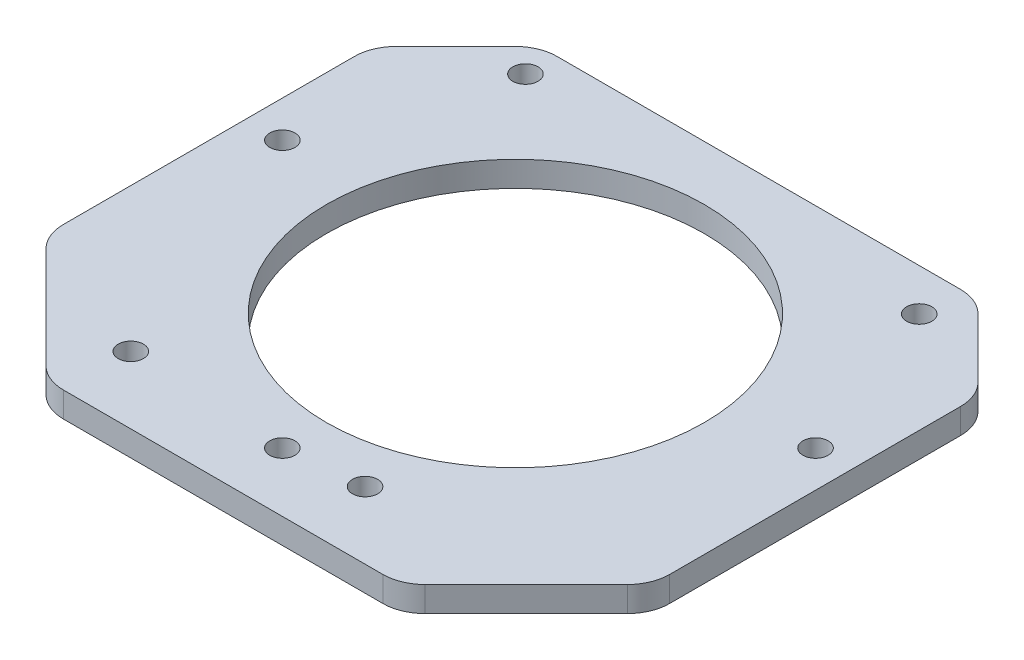
ISO-10303-21;
HEADER;
FILE_DESCRIPTION(('STEP AP214'),'2;1');
FILE_NAME('part.step','',(''),(''),'','','');
FILE_SCHEMA(('AUTOMOTIVE_DESIGN { 1 0 10303 214 1 1 1 1 }'));
ENDSEC;
DATA;
#1=APPLICATION_CONTEXT('core data for automotive mechanical design processes');
#2=APPLICATION_PROTOCOL_DEFINITION('international standard','automotive_design',2000,#1);
#3=PRODUCT_CONTEXT('',#1,'mechanical');
#4=PRODUCT('Part','Part','',(#3));
#5=PRODUCT_RELATED_PRODUCT_CATEGORY('part','',(#4));
#6=PRODUCT_DEFINITION_FORMATION('','',#4);
#7=PRODUCT_DEFINITION_CONTEXT('part definition',#1,'design');
#8=PRODUCT_DEFINITION('design','',#6,#7);
#9=PRODUCT_DEFINITION_SHAPE('','',#8);
#10=(LENGTH_UNIT() NAMED_UNIT(*) SI_UNIT(.MILLI.,.METRE.));
#11=(NAMED_UNIT(*) PLANE_ANGLE_UNIT() SI_UNIT($,.RADIAN.));
#12=(NAMED_UNIT(*) SI_UNIT($,.STERADIAN.) SOLID_ANGLE_UNIT());
#13=UNCERTAINTY_MEASURE_WITH_UNIT(LENGTH_MEASURE(1.E-05),#10,'distance_accuracy_value','');
#14=(GEOMETRIC_REPRESENTATION_CONTEXT(3) GLOBAL_UNCERTAINTY_ASSIGNED_CONTEXT((#13)) GLOBAL_UNIT_ASSIGNED_CONTEXT((#10,
#11,#12)) REPRESENTATION_CONTEXT('',''));
#15=CARTESIAN_POINT('',(0.,0.,0.));
#16=DIRECTION('',(0.,0.,1.));
#17=DIRECTION('',(1.,0.,0.));
#18=AXIS2_PLACEMENT_3D('',#15,#16,#17);
#19=CARTESIAN_POINT('',(0.,1.5,0.));
#20=DIRECTION('',(0.,1.,0.));
#21=DIRECTION('',(0.,0.,1.));
#22=AXIS2_PLACEMENT_3D('',#19,#20,#21);
#23=PLANE('',#22);
#24=CARTESIAN_POINT('',(-8.89999999999999,1.5,24.));
#25=DIRECTION('',(0.,-1.,0.));
#26=DIRECTION('',(0.,0.,-1.));
#27=AXIS2_PLACEMENT_3D('',#24,#25,#26);
#28=CIRCLE('',#27,22.5);
#29=CARTESIAN_POINT('',(-8.89999999999999,1.5,1.49999999999999));
#30=VERTEX_POINT('',#29);
#31=EDGE_CURVE('E336',#30,#30,#28,.T.);
#32=ORIENTED_EDGE('',*,*,#31,.T.);
#33=EDGE_LOOP('',(#32));
#34=FACE_BOUND('',#33,.T.);
#35=CARTESIAN_POINT('',(-40.65,1.5,20.));
#36=DIRECTION('',(0.,1.,0.));
#37=DIRECTION('',(0.,0.,-1.));
#38=AXIS2_PLACEMENT_3D('',#35,#36,#37);
#39=CIRCLE('',#38,1.5);
#40=CARTESIAN_POINT('',(-40.65,1.5,18.5));
#41=VERTEX_POINT('',#40);
#42=EDGE_CURVE('E324',#41,#41,#39,.T.);
#43=ORIENTED_EDGE('',*,*,#42,.F.);
#44=EDGE_LOOP('',(#43));
#45=FACE_BOUND('',#44,.T.);
#46=CARTESIAN_POINT('',(-27.9,1.5,50.8));
#47=DIRECTION('',(0.,1.,0.));
#48=DIRECTION('',(0.,0.,1.));
#49=AXIS2_PLACEMENT_3D('',#46,#47,#48);
#50=CIRCLE('',#49,1.5);
#51=CARTESIAN_POINT('',(-27.9,1.5,52.3));
#52=VERTEX_POINT('',#51);
#53=EDGE_CURVE('E312',#52,#52,#50,.T.);
#54=ORIENTED_EDGE('',*,*,#53,.F.);
#55=EDGE_LOOP('',(#54));
#56=FACE_BOUND('',#55,.T.);
#57=CARTESIAN_POINT('',(15.2,1.5,0.));
#58=DIRECTION('',(0.,1.,0.));
#59=DIRECTION('',(0.,0.,1.));
#60=AXIS2_PLACEMENT_3D('',#57,#58,#59);
#61=CIRCLE('',#60,1.5);
#62=CARTESIAN_POINT('',(15.2,1.5,1.5));
#63=VERTEX_POINT('',#62);
#64=EDGE_CURVE('E301',#63,#63,#61,.T.);
#65=ORIENTED_EDGE('',*,*,#64,.F.);
#66=EDGE_LOOP('',(#65));
#67=FACE_BOUND('',#66,.T.);
#68=DIRECTION('',(0.,0.,-1.));
#69=VECTOR('',#68,1.);
#70=CARTESIAN_POINT('',(27.2,1.5,-5.));
#71=LINE('',#70,#69);
#72=CARTESIAN_POINT('',(27.2,1.5,41.7289321881345));
#73=VERTEX_POINT('',#72);
#74=CARTESIAN_POINT('',(27.2,1.5,7.07106781186552));
#75=VERTEX_POINT('',#74);
#76=EDGE_CURVE('E166',#73,#75,#71,.T.);
#77=ORIENTED_EDGE('',*,*,#76,.T.);
#78=CARTESIAN_POINT('',(22.2,1.5,7.07106781186552));
#79=DIRECTION('',(0.,1.,0.));
#80=DIRECTION('',(0.,0.,1.));
#81=AXIS2_PLACEMENT_3D('',#78,#79,#80);
#82=CIRCLE('',#81,5.);
#83=CARTESIAN_POINT('',(25.7355339059327,1.5,3.53553390593279));
#84=VERTEX_POINT('',#83);
#85=EDGE_CURVE('E222',#75,#84,#82,.T.);
#86=ORIENTED_EDGE('',*,*,#85,.T.);
#87=DIRECTION('',(0.707106781186546,0.,0.707106781186549));
#88=VECTOR('',#87,1.);
#89=CARTESIAN_POINT('',(11.1,1.5,-11.1));
#90=LINE('',#89,#88);
#91=CARTESIAN_POINT('',(18.6644660940673,1.5,-3.53553390593273));
#92=VERTEX_POINT('',#91);
#93=EDGE_CURVE('E168',#84,#92,#90,.F.);
#94=ORIENTED_EDGE('',*,*,#93,.T.);
#95=CARTESIAN_POINT('',(15.1289321881345,1.5,0.));
#96=DIRECTION('',(0.,1.,0.));
#97=DIRECTION('',(0.,0.,1.));
#98=AXIS2_PLACEMENT_3D('',#95,#96,#97);
#99=CIRCLE('',#98,5.);
#100=CARTESIAN_POINT('',(15.1289321881345,1.5,-5.));
#101=VERTEX_POINT('',#100);
#102=EDGE_CURVE('E220',#92,#101,#99,.T.);
#103=ORIENTED_EDGE('',*,*,#102,.T.);
#104=DIRECTION('',(-1.,0.,0.));
#105=VECTOR('',#104,1.);
#106=CARTESIAN_POINT('',(-45.,1.5,-5.));
#107=LINE('',#106,#105);
#108=CARTESIAN_POINT('',(-32.9289321881345,1.5,-5.));
#109=VERTEX_POINT('',#108);
#110=EDGE_CURVE('E190',#101,#109,#107,.T.);
#111=ORIENTED_EDGE('',*,*,#110,.T.);
#112=CARTESIAN_POINT('',(-32.9289321881345,1.5,0.));
#113=DIRECTION('',(0.,1.,0.));
#114=DIRECTION('',(0.,0.,1.));
#115=AXIS2_PLACEMENT_3D('',#112,#113,#114);
#116=CIRCLE('',#115,5.);
#117=CARTESIAN_POINT('',(-36.4644660940672,1.5,-3.53553390593274));
#118=VERTEX_POINT('',#117);
#119=EDGE_CURVE('E216',#109,#118,#116,.T.);
#120=ORIENTED_EDGE('',*,*,#119,.T.);
#121=DIRECTION('',(0.707106781186549,0.,-0.707106781186546));
#122=VECTOR('',#121,1.);
#123=CARTESIAN_POINT('',(-19.9999999999999,1.5,-20.));
#124=LINE('',#123,#122);
#125=CARTESIAN_POINT('',(-43.5355339059327,1.5,3.53553390593275));
#126=VERTEX_POINT('',#125);
#127=EDGE_CURVE('E202',#118,#126,#124,.F.);
#128=ORIENTED_EDGE('',*,*,#127,.T.);
#129=CARTESIAN_POINT('',(-40.,1.5,7.07106781186549));
#130=DIRECTION('',(0.,1.,0.));
#131=DIRECTION('',(0.,0.,1.));
#132=AXIS2_PLACEMENT_3D('',#129,#130,#131);
#133=CIRCLE('',#132,5.);
#134=CARTESIAN_POINT('',(-45.,1.5,7.07106781186549));
#135=VERTEX_POINT('',#134);
#136=EDGE_CURVE('E218',#126,#135,#133,.T.);
#137=ORIENTED_EDGE('',*,*,#136,.T.);
#138=DIRECTION('',(0.,0.,1.));
#139=VECTOR('',#138,1.);
#140=CARTESIAN_POINT('',(-45.,1.5,-5.));
#141=LINE('',#140,#139);
#142=CARTESIAN_POINT('',(-45.,1.5,41.7289321881345));
#143=VERTEX_POINT('',#142);
#144=EDGE_CURVE('E179',#135,#143,#141,.T.);
#145=ORIENTED_EDGE('',*,*,#144,.T.);
#146=CARTESIAN_POINT('',(-40.,1.5,41.7289321881345));
#147=DIRECTION('',(0.,1.,0.));
#148=DIRECTION('',(0.,0.,1.));
#149=AXIS2_PLACEMENT_3D('',#146,#147,#148);
#150=CIRCLE('',#149,5.);
#151=CARTESIAN_POINT('',(-43.5355339059327,1.5,45.2644660940672));
#152=VERTEX_POINT('',#151);
#153=EDGE_CURVE('E210',#143,#152,#150,.T.);
#154=ORIENTED_EDGE('',*,*,#153,.T.);
#155=DIRECTION('',(-0.707106781186546,0.,-0.707106781186549));
#156=VECTOR('',#155,1.);
#157=CARTESIAN_POINT('',(-44.4,1.5,44.3999999999999));
#158=LINE('',#157,#156);
#159=CARTESIAN_POINT('',(-31.4644660940672,1.5,57.3355339059327));
#160=VERTEX_POINT('',#159);
#161=EDGE_CURVE('E192',#152,#160,#158,.F.);
#162=ORIENTED_EDGE('',*,*,#161,.T.);
#163=CARTESIAN_POINT('',(-27.9289321881345,1.5,53.8));
#164=DIRECTION('',(0.,1.,0.));
#165=DIRECTION('',(0.,0.,1.));
#166=AXIS2_PLACEMENT_3D('',#163,#164,#165);
#167=CIRCLE('',#166,5.);
#168=CARTESIAN_POINT('',(-27.9289321881345,1.5,58.8));
#169=VERTEX_POINT('',#168);
#170=EDGE_CURVE('E208',#160,#169,#167,.T.);
#171=ORIENTED_EDGE('',*,*,#170,.T.);
#172=DIRECTION('',(1.,0.,0.));
#173=VECTOR('',#172,1.);
#174=CARTESIAN_POINT('',(-45.,1.5,58.8));
#175=LINE('',#174,#173);
#176=CARTESIAN_POINT('',(10.1289321881345,1.5,58.8));
#177=VERTEX_POINT('',#176);
#178=EDGE_CURVE('E279',#169,#177,#175,.T.);
#179=ORIENTED_EDGE('',*,*,#178,.T.);
#180=CARTESIAN_POINT('',(10.1289321881345,1.5,53.8));
#181=DIRECTION('',(0.,1.,0.));
#182=DIRECTION('',(0.,0.,1.));
#183=AXIS2_PLACEMENT_3D('',#180,#181,#182);
#184=CIRCLE('',#183,5.);
#185=CARTESIAN_POINT('',(13.6644660940672,1.5,57.3355339059328));
#186=VERTEX_POINT('',#185);
#187=EDGE_CURVE('E212',#177,#186,#184,.T.);
#188=ORIENTED_EDGE('',*,*,#187,.T.);
#189=DIRECTION('',(-0.707106781186549,0.,0.707106781186546));
#190=VECTOR('',#189,1.);
#191=CARTESIAN_POINT('',(35.4999999999999,1.5,35.5000000000001));
#192=LINE('',#191,#190);
#193=CARTESIAN_POINT('',(25.7355339059327,1.5,45.2644660940673));
#194=VERTEX_POINT('',#193);
#195=EDGE_CURVE('E195',#186,#194,#192,.F.);
#196=ORIENTED_EDGE('',*,*,#195,.T.);
#197=CARTESIAN_POINT('',(22.2,1.5,41.7289321881345));
#198=DIRECTION('',(0.,1.,0.));
#199=DIRECTION('',(0.,0.,1.));
#200=AXIS2_PLACEMENT_3D('',#197,#198,#199);
#201=CIRCLE('',#200,5.);
#202=EDGE_CURVE('E214',#194,#73,#201,.T.);
#203=ORIENTED_EDGE('',*,*,#202,.T.);
#204=EDGE_LOOP('',(#77,#86,#94,#103,#111,#120,#128,#137,#145,#154,#162,#171,#179,#188,#196,#203));
#205=FACE_BOUND('',#204,.T.);
#206=CARTESIAN_POINT('',(-33.,1.5,-1.3));
#207=DIRECTION('',(0.,1.,0.));
#208=DIRECTION('',(0.,0.,1.));
#209=AXIS2_PLACEMENT_3D('',#206,#207,#208);
#210=CIRCLE('',#209,1.5);
#211=CARTESIAN_POINT('',(-33.,1.5,0.200000000000004));
#212=VERTEX_POINT('',#211);
#213=EDGE_CURVE('E292',#212,#212,#210,.T.);
#214=ORIENTED_EDGE('',*,*,#213,.F.);
#215=EDGE_LOOP('',(#214));
#216=FACE_BOUND('',#215,.T.);
#217=CARTESIAN_POINT('',(0.,1.5,50.8));
#218=DIRECTION('',(0.,1.,0.));
#219=DIRECTION('',(0.,0.,1.));
#220=AXIS2_PLACEMENT_3D('',#217,#218,#219);
#221=CIRCLE('',#220,1.5);
#222=CARTESIAN_POINT('',(0.,1.5,52.3));
#223=VERTEX_POINT('',#222);
#224=EDGE_CURVE('E306',#223,#223,#221,.T.);
#225=ORIENTED_EDGE('',*,*,#224,.F.);
#226=EDGE_LOOP('',(#225));
#227=FACE_BOUND('',#226,.T.);
#228=CARTESIAN_POINT('',(22.85,1.5,20.));
#229=DIRECTION('',(0.,1.,0.));
#230=DIRECTION('',(0.,0.,1.));
#231=AXIS2_PLACEMENT_3D('',#228,#229,#230);
#232=CIRCLE('',#231,1.5);
#233=CARTESIAN_POINT('',(22.85,1.5,21.5));
#234=VERTEX_POINT('',#233);
#235=EDGE_CURVE('E318',#234,#234,#232,.T.);
#236=ORIENTED_EDGE('',*,*,#235,.F.);
#237=EDGE_LOOP('',(#236));
#238=FACE_BOUND('',#237,.T.);
#239=CARTESIAN_POINT('',(-8.9,1.5,51.75));
#240=DIRECTION('',(0.,1.,0.));
#241=DIRECTION('',(0.,0.,1.));
#242=AXIS2_PLACEMENT_3D('',#239,#240,#241);
#243=CIRCLE('',#242,1.5);
#244=CARTESIAN_POINT('',(-8.9,1.5,53.25));
#245=VERTEX_POINT('',#244);
#246=EDGE_CURVE('E330',#245,#245,#243,.T.);
#247=ORIENTED_EDGE('',*,*,#246,.F.);
#248=EDGE_LOOP('',(#247));
#249=FACE_BOUND('',#248,.T.);
#250=ADVANCED_FACE('F33',(#34,#45,#56,#67,#205,#216,#227,#238,#249),#23,.T.);
#251=CARTESIAN_POINT('',(0.,-1.5,0.));
#252=DIRECTION('',(0.,1.,0.));
#253=DIRECTION('',(0.,0.,1.));
#254=AXIS2_PLACEMENT_3D('',#251,#252,#253);
#255=PLANE('',#254);
#256=CARTESIAN_POINT('',(-8.89999999999999,-1.5,24.));
#257=DIRECTION('',(0.,-1.,0.));
#258=DIRECTION('',(0.,0.,-1.));
#259=AXIS2_PLACEMENT_3D('',#256,#257,#258);
#260=CIRCLE('',#259,22.5);
#261=CARTESIAN_POINT('',(-8.89999999999999,-1.5,1.49999999999999));
#262=VERTEX_POINT('',#261);
#263=EDGE_CURVE('E339',#262,#262,#260,.T.);
#264=ORIENTED_EDGE('',*,*,#263,.F.);
#265=EDGE_LOOP('',(#264));
#266=FACE_BOUND('',#265,.T.);
#267=DIRECTION('',(-0.707106781186546,0.,-0.707106781186549));
#268=VECTOR('',#267,1.);
#269=CARTESIAN_POINT('',(17.2,-1.5,-5.));
#270=LINE('',#269,#268);
#271=CARTESIAN_POINT('',(18.6644660940673,-1.5,-3.53553390593273));
#272=VERTEX_POINT('',#271);
#273=CARTESIAN_POINT('',(25.7355339059327,-1.5,3.53553390593279));
#274=VERTEX_POINT('',#273);
#275=EDGE_CURVE('E200',#272,#274,#270,.F.);
#276=ORIENTED_EDGE('',*,*,#275,.T.);
#277=CARTESIAN_POINT('',(22.2,-1.5,7.07106781186552));
#278=DIRECTION('',(0.,1.,0.));
#279=DIRECTION('',(0.,0.,1.));
#280=AXIS2_PLACEMENT_3D('',#277,#278,#279);
#281=CIRCLE('',#280,5.);
#282=CARTESIAN_POINT('',(27.2,-1.5,7.07106781186552));
#283=VERTEX_POINT('',#282);
#284=EDGE_CURVE('E174',#274,#283,#281,.F.);
#285=ORIENTED_EDGE('',*,*,#284,.T.);
#286=DIRECTION('',(0.,0.,-1.));
#287=VECTOR('',#286,1.);
#288=CARTESIAN_POINT('',(27.2,-1.5,-5.));
#289=LINE('',#288,#287);
#290=CARTESIAN_POINT('',(27.2,-1.5,41.7289321881345));
#291=VERTEX_POINT('',#290);
#292=EDGE_CURVE('E163',#291,#283,#289,.T.);
#293=ORIENTED_EDGE('',*,*,#292,.F.);
#294=CARTESIAN_POINT('',(22.2,-1.5,41.7289321881345));
#295=DIRECTION('',(0.,1.,0.));
#296=DIRECTION('',(0.,0.,1.));
#297=AXIS2_PLACEMENT_3D('',#294,#295,#296);
#298=CIRCLE('',#297,5.);
#299=CARTESIAN_POINT('',(25.7355339059327,-1.5,45.2644660940673));
#300=VERTEX_POINT('',#299);
#301=EDGE_CURVE('E146',#291,#300,#298,.F.);
#302=ORIENTED_EDGE('',*,*,#301,.T.);
#303=DIRECTION('',(0.707106781186549,0.,-0.707106781186546));
#304=VECTOR('',#303,1.);
#305=CARTESIAN_POINT('',(27.2,-1.5,43.8));
#306=LINE('',#305,#304);
#307=CARTESIAN_POINT('',(13.6644660940672,-1.5,57.3355339059328));
#308=VERTEX_POINT('',#307);
#309=EDGE_CURVE('E189',#300,#308,#306,.F.);
#310=ORIENTED_EDGE('',*,*,#309,.T.);
#311=CARTESIAN_POINT('',(10.1289321881345,-1.5,53.8));
#312=DIRECTION('',(0.,1.,0.));
#313=DIRECTION('',(0.,0.,1.));
#314=AXIS2_PLACEMENT_3D('',#311,#312,#313);
#315=CIRCLE('',#314,5.);
#316=CARTESIAN_POINT('',(10.1289321881345,-1.5,58.8));
#317=VERTEX_POINT('',#316);
#318=EDGE_CURVE('E156',#308,#317,#315,.F.);
#319=ORIENTED_EDGE('',*,*,#318,.T.);
#320=DIRECTION('',(1.,0.,0.));
#321=VECTOR('',#320,1.);
#322=CARTESIAN_POINT('',(-45.,-1.5,58.8));
#323=LINE('',#322,#321);
#324=CARTESIAN_POINT('',(-27.9289321881345,-1.5,58.8));
#325=VERTEX_POINT('',#324);
#326=EDGE_CURVE('E176',#325,#317,#323,.T.);
#327=ORIENTED_EDGE('',*,*,#326,.F.);
#328=CARTESIAN_POINT('',(-27.9289321881345,-1.5,53.8));
#329=DIRECTION('',(0.,1.,0.));
#330=DIRECTION('',(0.,0.,1.));
#331=AXIS2_PLACEMENT_3D('',#328,#329,#330);
#332=CIRCLE('',#331,5.);
#333=CARTESIAN_POINT('',(-31.4644660940672,-1.5,57.3355339059327));
#334=VERTEX_POINT('',#333);
#335=EDGE_CURVE('E228',#325,#334,#332,.F.);
#336=ORIENTED_EDGE('',*,*,#335,.T.);
#337=DIRECTION('',(0.707106781186546,0.,0.707106781186549));
#338=VECTOR('',#337,1.);
#339=CARTESIAN_POINT('',(-30.,-1.5,58.8));
#340=LINE('',#339,#338);
#341=CARTESIAN_POINT('',(-43.5355339059327,-1.5,45.2644660940672));
#342=VERTEX_POINT('',#341);
#343=EDGE_CURVE('E186',#334,#342,#340,.F.);
#344=ORIENTED_EDGE('',*,*,#343,.T.);
#345=CARTESIAN_POINT('',(-40.,-1.5,41.7289321881345));
#346=DIRECTION('',(0.,1.,0.));
#347=DIRECTION('',(0.,0.,1.));
#348=AXIS2_PLACEMENT_3D('',#345,#346,#347);
#349=CIRCLE('',#348,5.);
#350=CARTESIAN_POINT('',(-45.,-1.5,41.7289321881345));
#351=VERTEX_POINT('',#350);
#352=EDGE_CURVE('E230',#342,#351,#349,.F.);
#353=ORIENTED_EDGE('',*,*,#352,.T.);
#354=DIRECTION('',(0.,0.,1.));
#355=VECTOR('',#354,1.);
#356=CARTESIAN_POINT('',(-45.,-1.5,-5.));
#357=LINE('',#356,#355);
#358=CARTESIAN_POINT('',(-45.,-1.5,7.07106781186549));
#359=VERTEX_POINT('',#358);
#360=EDGE_CURVE('E182',#359,#351,#357,.T.);
#361=ORIENTED_EDGE('',*,*,#360,.F.);
#362=CARTESIAN_POINT('',(-40.,-1.5,7.07106781186549));
#363=DIRECTION('',(0.,1.,0.));
#364=DIRECTION('',(0.,0.,1.));
#365=AXIS2_PLACEMENT_3D('',#362,#363,#364);
#366=CIRCLE('',#365,5.);
#367=CARTESIAN_POINT('',(-43.5355339059327,-1.5,3.53553390593275));
#368=VERTEX_POINT('',#367);
#369=EDGE_CURVE('E55',#359,#368,#366,.F.);
#370=ORIENTED_EDGE('',*,*,#369,.T.);
#371=DIRECTION('',(-0.707106781186549,0.,0.707106781186546));
#372=VECTOR('',#371,1.);
#373=CARTESIAN_POINT('',(-45.,-1.5,5.00000000000001));
#374=LINE('',#373,#372);
#375=CARTESIAN_POINT('',(-36.4644660940672,-1.5,-3.53553390593275));
#376=VERTEX_POINT('',#375);
#377=EDGE_CURVE('E198',#368,#376,#374,.F.);
#378=ORIENTED_EDGE('',*,*,#377,.T.);
#379=CARTESIAN_POINT('',(-32.9289321881345,-1.5,0.));
#380=DIRECTION('',(0.,1.,0.));
#381=DIRECTION('',(0.,0.,1.));
#382=AXIS2_PLACEMENT_3D('',#379,#380,#381);
#383=CIRCLE('',#382,5.);
#384=CARTESIAN_POINT('',(-32.9289321881345,-1.5,-5.));
#385=VERTEX_POINT('',#384);
#386=EDGE_CURVE('E155',#376,#385,#383,.F.);
#387=ORIENTED_EDGE('',*,*,#386,.T.);
#388=DIRECTION('',(-1.,0.,0.));
#389=VECTOR('',#388,1.);
#390=CARTESIAN_POINT('',(-45.,-1.5,-5.));
#391=LINE('',#390,#389);
#392=CARTESIAN_POINT('',(15.1289321881345,-1.5,-5.));
#393=VERTEX_POINT('',#392);
#394=EDGE_CURVE('E175',#393,#385,#391,.T.);
#395=ORIENTED_EDGE('',*,*,#394,.F.);
#396=CARTESIAN_POINT('',(15.1289321881345,-1.5,0.));
#397=DIRECTION('',(0.,1.,0.));
#398=DIRECTION('',(0.,0.,1.));
#399=AXIS2_PLACEMENT_3D('',#396,#397,#398);
#400=CIRCLE('',#399,5.);
#401=EDGE_CURVE('E235',#393,#272,#400,.F.);
#402=ORIENTED_EDGE('',*,*,#401,.T.);
#403=EDGE_LOOP('',(#276,#285,#293,#302,#310,#319,#327,#336,#344,#353,#361,#370,#378,#387,#395,#402));
#404=FACE_BOUND('',#403,.T.);
#405=CARTESIAN_POINT('',(-33.,-1.5,-1.3));
#406=DIRECTION('',(0.,1.,0.));
#407=DIRECTION('',(0.,0.,1.));
#408=AXIS2_PLACEMENT_3D('',#405,#406,#407);
#409=CIRCLE('',#408,1.5);
#410=CARTESIAN_POINT('',(-33.,-1.5,0.200000000000004));
#411=VERTEX_POINT('',#410);
#412=EDGE_CURVE('E296',#411,#411,#409,.T.);
#413=ORIENTED_EDGE('',*,*,#412,.T.);
#414=EDGE_LOOP('',(#413));
#415=FACE_BOUND('',#414,.T.);
#416=CARTESIAN_POINT('',(15.2,-1.5,0.));
#417=DIRECTION('',(0.,1.,0.));
#418=DIRECTION('',(0.,0.,1.));
#419=AXIS2_PLACEMENT_3D('',#416,#417,#418);
#420=CIRCLE('',#419,1.5);
#421=CARTESIAN_POINT('',(15.2,-1.5,1.5));
#422=VERTEX_POINT('',#421);
#423=EDGE_CURVE('E303',#422,#422,#420,.T.);
#424=ORIENTED_EDGE('',*,*,#423,.T.);
#425=EDGE_LOOP('',(#424));
#426=FACE_BOUND('',#425,.T.);
#427=CARTESIAN_POINT('',(0.,-1.5,50.8));
#428=DIRECTION('',(0.,1.,0.));
#429=DIRECTION('',(0.,0.,1.));
#430=AXIS2_PLACEMENT_3D('',#427,#428,#429);
#431=CIRCLE('',#430,1.5);
#432=CARTESIAN_POINT('',(0.,-1.5,52.3));
#433=VERTEX_POINT('',#432);
#434=EDGE_CURVE('E309',#433,#433,#431,.T.);
#435=ORIENTED_EDGE('',*,*,#434,.T.);
#436=EDGE_LOOP('',(#435));
#437=FACE_BOUND('',#436,.T.);
#438=CARTESIAN_POINT('',(-27.9,-1.5,50.8));
#439=DIRECTION('',(0.,1.,0.));
#440=DIRECTION('',(0.,0.,1.));
#441=AXIS2_PLACEMENT_3D('',#438,#439,#440);
#442=CIRCLE('',#441,1.5);
#443=CARTESIAN_POINT('',(-27.9,-1.5,52.3));
#444=VERTEX_POINT('',#443);
#445=EDGE_CURVE('E315',#444,#444,#442,.T.);
#446=ORIENTED_EDGE('',*,*,#445,.T.);
#447=EDGE_LOOP('',(#446));
#448=FACE_BOUND('',#447,.T.);
#449=CARTESIAN_POINT('',(22.85,-1.5,20.));
#450=DIRECTION('',(0.,1.,0.));
#451=DIRECTION('',(0.,0.,1.));
#452=AXIS2_PLACEMENT_3D('',#449,#450,#451);
#453=CIRCLE('',#452,1.5);
#454=CARTESIAN_POINT('',(22.85,-1.5,21.5));
#455=VERTEX_POINT('',#454);
#456=EDGE_CURVE('E321',#455,#455,#453,.T.);
#457=ORIENTED_EDGE('',*,*,#456,.T.);
#458=EDGE_LOOP('',(#457));
#459=FACE_BOUND('',#458,.T.);
#460=CARTESIAN_POINT('',(-40.65,-1.5,20.));
#461=DIRECTION('',(0.,1.,0.));
#462=DIRECTION('',(0.,0.,-1.));
#463=AXIS2_PLACEMENT_3D('',#460,#461,#462);
#464=CIRCLE('',#463,1.5);
#465=CARTESIAN_POINT('',(-40.65,-1.5,18.5));
#466=VERTEX_POINT('',#465);
#467=EDGE_CURVE('E327',#466,#466,#464,.T.);
#468=ORIENTED_EDGE('',*,*,#467,.T.);
#469=EDGE_LOOP('',(#468));
#470=FACE_BOUND('',#469,.T.);
#471=CARTESIAN_POINT('',(-8.9,-1.5,51.75));
#472=DIRECTION('',(0.,1.,0.));
#473=DIRECTION('',(0.,0.,1.));
#474=AXIS2_PLACEMENT_3D('',#471,#472,#473);
#475=CIRCLE('',#474,1.5);
#476=CARTESIAN_POINT('',(-8.9,-1.5,53.25));
#477=VERTEX_POINT('',#476);
#478=EDGE_CURVE('E333',#477,#477,#475,.T.);
#479=ORIENTED_EDGE('',*,*,#478,.T.);
#480=EDGE_LOOP('',(#479));
#481=FACE_BOUND('',#480,.T.);
#482=ADVANCED_FACE('F171',(#266,#404,#415,#426,#437,#448,#459,#470,#481),#255,.F.);
#483=CARTESIAN_POINT('',(-45.,1.5,-5.));
#484=DIRECTION('',(1.,0.,0.));
#485=DIRECTION('',(0.,0.,-1.));
#486=AXIS2_PLACEMENT_3D('',#483,#484,#485);
#487=PLANE('',#486);
#488=ORIENTED_EDGE('',*,*,#144,.F.);
#489=DIRECTION('',(0.,1.,0.));
#490=VECTOR('',#489,1.);
#491=CARTESIAN_POINT('',(-45.,-1.5,7.07106781186549));
#492=LINE('',#491,#490);
#493=EDGE_CURVE('E247',#135,#359,#492,.F.);
#494=ORIENTED_EDGE('',*,*,#493,.T.);
#495=ORIENTED_EDGE('',*,*,#360,.T.);
#496=DIRECTION('',(0.,-1.,0.));
#497=VECTOR('',#496,1.);
#498=CARTESIAN_POINT('',(-45.,1.5,41.7289321881345));
#499=LINE('',#498,#497);
#500=EDGE_CURVE('E244',#351,#143,#499,.F.);
#501=ORIENTED_EDGE('',*,*,#500,.T.);
#502=EDGE_LOOP('',(#488,#494,#495,#501));
#503=FACE_BOUND('',#502,.T.);
#504=ADVANCED_FACE('F356',(#503),#487,.F.);
#505=CARTESIAN_POINT('',(-45.,1.5,58.8));
#506=DIRECTION('',(0.,0.,-1.));
#507=DIRECTION('',(-1.,0.,0.));
#508=AXIS2_PLACEMENT_3D('',#505,#506,#507);
#509=PLANE('',#508);
#510=ORIENTED_EDGE('',*,*,#326,.T.);
#511=DIRECTION('',(0.,-1.,0.));
#512=VECTOR('',#511,1.);
#513=CARTESIAN_POINT('',(10.1289321881345,1.5,58.8));
#514=LINE('',#513,#512);
#515=EDGE_CURVE('E259',#317,#177,#514,.F.);
#516=ORIENTED_EDGE('',*,*,#515,.T.);
#517=ORIENTED_EDGE('',*,*,#178,.F.);
#518=DIRECTION('',(0.,1.,0.));
#519=VECTOR('',#518,1.);
#520=CARTESIAN_POINT('',(-27.9289321881345,-1.5,58.8));
#521=LINE('',#520,#519);
#522=EDGE_CURVE('E256',#169,#325,#521,.F.);
#523=ORIENTED_EDGE('',*,*,#522,.T.);
#524=EDGE_LOOP('',(#510,#516,#517,#523));
#525=FACE_BOUND('',#524,.T.);
#526=ADVANCED_FACE('F277',(#525),#509,.F.);
#527=CARTESIAN_POINT('',(27.2,1.5,-5.));
#528=DIRECTION('',(-1.,0.,0.));
#529=DIRECTION('',(0.,0.,1.));
#530=AXIS2_PLACEMENT_3D('',#527,#528,#529);
#531=PLANE('',#530);
#532=ORIENTED_EDGE('',*,*,#292,.T.);
#533=DIRECTION('',(0.,-1.,0.));
#534=VECTOR('',#533,1.);
#535=CARTESIAN_POINT('',(27.2,1.5,7.07106781186552));
#536=LINE('',#535,#534);
#537=EDGE_CURVE('E167',#283,#75,#536,.F.);
#538=ORIENTED_EDGE('',*,*,#537,.T.);
#539=ORIENTED_EDGE('',*,*,#76,.F.);
#540=DIRECTION('',(0.,1.,0.));
#541=VECTOR('',#540,1.);
#542=CARTESIAN_POINT('',(27.2,-1.5,41.7289321881345));
#543=LINE('',#542,#541);
#544=EDGE_CURVE('E150',#73,#291,#543,.F.);
#545=ORIENTED_EDGE('',*,*,#544,.T.);
#546=EDGE_LOOP('',(#532,#538,#539,#545));
#547=FACE_BOUND('',#546,.T.);
#548=ADVANCED_FACE('F161',(#547),#531,.F.);
#549=CARTESIAN_POINT('',(-45.,1.5,-5.));
#550=DIRECTION('',(0.,0.,1.));
#551=DIRECTION('',(1.,0.,0.));
#552=AXIS2_PLACEMENT_3D('',#549,#550,#551);
#553=PLANE('',#552);
#554=ORIENTED_EDGE('',*,*,#110,.F.);
#555=DIRECTION('',(0.,1.,0.));
#556=VECTOR('',#555,1.);
#557=CARTESIAN_POINT('',(15.1289321881345,-1.5,-5.));
#558=LINE('',#557,#556);
#559=EDGE_CURVE('E241',#101,#393,#558,.F.);
#560=ORIENTED_EDGE('',*,*,#559,.T.);
#561=ORIENTED_EDGE('',*,*,#394,.T.);
#562=DIRECTION('',(0.,-1.,0.));
#563=VECTOR('',#562,1.);
#564=CARTESIAN_POINT('',(-32.9289321881345,1.5,-5.));
#565=LINE('',#564,#563);
#566=EDGE_CURVE('E238',#385,#109,#565,.F.);
#567=ORIENTED_EDGE('',*,*,#566,.T.);
#568=EDGE_LOOP('',(#554,#560,#561,#567));
#569=FACE_BOUND('',#568,.T.);
#570=ADVANCED_FACE('F366',(#569),#553,.F.);
#571=CARTESIAN_POINT('',(-33.,1.5,-1.3));
#572=DIRECTION('',(0.,-1.,0.));
#573=DIRECTION('',(0.,0.,-1.));
#574=AXIS2_PLACEMENT_3D('',#571,#572,#573);
#575=CYLINDRICAL_SURFACE('',#574,1.5);
#576=ORIENTED_EDGE('',*,*,#213,.T.);
#577=EDGE_LOOP('',(#576));
#578=FACE_BOUND('',#577,.T.);
#579=ORIENTED_EDGE('',*,*,#412,.F.);
#580=EDGE_LOOP('',(#579));
#581=FACE_BOUND('',#580,.T.);
#582=ADVANCED_FACE('F369',(#578,#581),#575,.F.);
#583=CARTESIAN_POINT('',(15.2,1.5,0.));
#584=DIRECTION('',(0.,-1.,0.));
#585=DIRECTION('',(0.,0.,-1.));
#586=AXIS2_PLACEMENT_3D('',#583,#584,#585);
#587=CYLINDRICAL_SURFACE('',#586,1.5);
#588=ORIENTED_EDGE('',*,*,#64,.T.);
#589=EDGE_LOOP('',(#588));
#590=FACE_BOUND('',#589,.T.);
#591=ORIENTED_EDGE('',*,*,#423,.F.);
#592=EDGE_LOOP('',(#591));
#593=FACE_BOUND('',#592,.T.);
#594=ADVANCED_FACE('F569',(#590,#593),#587,.F.);
#595=CARTESIAN_POINT('',(0.,1.5,50.8));
#596=DIRECTION('',(0.,-1.,0.));
#597=DIRECTION('',(0.,0.,-1.));
#598=AXIS2_PLACEMENT_3D('',#595,#596,#597);
#599=CYLINDRICAL_SURFACE('',#598,1.5);
#600=ORIENTED_EDGE('',*,*,#224,.T.);
#601=EDGE_LOOP('',(#600));
#602=FACE_BOUND('',#601,.T.);
#603=ORIENTED_EDGE('',*,*,#434,.F.);
#604=EDGE_LOOP('',(#603));
#605=FACE_BOUND('',#604,.T.);
#606=ADVANCED_FACE('F559',(#602,#605),#599,.F.);
#607=CARTESIAN_POINT('',(-27.9,1.5,50.8));
#608=DIRECTION('',(0.,-1.,0.));
#609=DIRECTION('',(0.,0.,-1.));
#610=AXIS2_PLACEMENT_3D('',#607,#608,#609);
#611=CYLINDRICAL_SURFACE('',#610,1.5);
#612=ORIENTED_EDGE('',*,*,#53,.T.);
#613=EDGE_LOOP('',(#612));
#614=FACE_BOUND('',#613,.T.);
#615=ORIENTED_EDGE('',*,*,#445,.F.);
#616=EDGE_LOOP('',(#615));
#617=FACE_BOUND('',#616,.T.);
#618=ADVANCED_FACE('F549',(#614,#617),#611,.F.);
#619=CARTESIAN_POINT('',(22.85,1.5,20.));
#620=DIRECTION('',(0.,-1.,0.));
#621=DIRECTION('',(0.,0.,-1.));
#622=AXIS2_PLACEMENT_3D('',#619,#620,#621);
#623=CYLINDRICAL_SURFACE('',#622,1.5);
#624=ORIENTED_EDGE('',*,*,#235,.T.);
#625=EDGE_LOOP('',(#624));
#626=FACE_BOUND('',#625,.T.);
#627=ORIENTED_EDGE('',*,*,#456,.F.);
#628=EDGE_LOOP('',(#627));
#629=FACE_BOUND('',#628,.T.);
#630=ADVANCED_FACE('F539',(#626,#629),#623,.F.);
#631=CARTESIAN_POINT('',(-40.65,1.5,20.));
#632=DIRECTION('',(0.,-1.,0.));
#633=DIRECTION('',(0.,0.,-1.));
#634=AXIS2_PLACEMENT_3D('',#631,#632,#633);
#635=CYLINDRICAL_SURFACE('',#634,1.5);
#636=ORIENTED_EDGE('',*,*,#42,.T.);
#637=EDGE_LOOP('',(#636));
#638=FACE_BOUND('',#637,.T.);
#639=ORIENTED_EDGE('',*,*,#467,.F.);
#640=EDGE_LOOP('',(#639));
#641=FACE_BOUND('',#640,.T.);
#642=ADVANCED_FACE('F529',(#638,#641),#635,.F.);
#643=CARTESIAN_POINT('',(-8.9,1.5,51.75));
#644=DIRECTION('',(0.,-1.,0.));
#645=DIRECTION('',(0.,0.,-1.));
#646=AXIS2_PLACEMENT_3D('',#643,#644,#645);
#647=CYLINDRICAL_SURFACE('',#646,1.5);
#648=ORIENTED_EDGE('',*,*,#246,.T.);
#649=EDGE_LOOP('',(#648));
#650=FACE_BOUND('',#649,.T.);
#651=ORIENTED_EDGE('',*,*,#478,.F.);
#652=EDGE_LOOP('',(#651));
#653=FACE_BOUND('',#652,.T.);
#654=ADVANCED_FACE('F378',(#650,#653),#647,.F.);
#655=CARTESIAN_POINT('',(27.2,1.5,43.8));
#656=DIRECTION('',(-0.707106781186546,0.,-0.707106781186549));
#657=DIRECTION('',(0.,-1.,0.));
#658=AXIS2_PLACEMENT_3D('',#655,#656,#657);
#659=PLANE('',#658);
#660=ORIENTED_EDGE('',*,*,#309,.F.);
#661=DIRECTION('',(0.,-1.,0.));
#662=VECTOR('',#661,1.);
#663=CARTESIAN_POINT('',(25.7355339059327,1.5,45.2644660940673));
#664=LINE('',#663,#662);
#665=EDGE_CURVE('E151',#300,#194,#664,.F.);
#666=ORIENTED_EDGE('',*,*,#665,.T.);
#667=ORIENTED_EDGE('',*,*,#195,.F.);
#668=DIRECTION('',(0.,1.,0.));
#669=VECTOR('',#668,1.);
#670=CARTESIAN_POINT('',(13.6644660940672,-1.5,57.3355339059328));
#671=LINE('',#670,#669);
#672=EDGE_CURVE('E253',#186,#308,#671,.F.);
#673=ORIENTED_EDGE('',*,*,#672,.T.);
#674=EDGE_LOOP('',(#660,#666,#667,#673));
#675=FACE_BOUND('',#674,.T.);
#676=ADVANCED_FACE('F375',(#675),#659,.F.);
#677=CARTESIAN_POINT('',(-30.,1.5,58.8));
#678=DIRECTION('',(0.707106781186549,0.,-0.707106781186546));
#679=DIRECTION('',(0.,-1.,0.));
#680=AXIS2_PLACEMENT_3D('',#677,#678,#679);
#681=PLANE('',#680);
#682=ORIENTED_EDGE('',*,*,#161,.F.);
#683=DIRECTION('',(0.,1.,0.));
#684=VECTOR('',#683,1.);
#685=CARTESIAN_POINT('',(-43.5355339059327,-1.5,45.2644660940672));
#686=LINE('',#685,#684);
#687=EDGE_CURVE('E11',#152,#342,#686,.F.);
#688=ORIENTED_EDGE('',*,*,#687,.T.);
#689=ORIENTED_EDGE('',*,*,#343,.F.);
#690=DIRECTION('',(0.,-1.,0.));
#691=VECTOR('',#690,1.);
#692=CARTESIAN_POINT('',(-31.4644660940672,1.5,57.3355339059327));
#693=LINE('',#692,#691);
#694=EDGE_CURVE('E41',#334,#160,#693,.F.);
#695=ORIENTED_EDGE('',*,*,#694,.T.);
#696=EDGE_LOOP('',(#682,#688,#689,#695));
#697=FACE_BOUND('',#696,.T.);
#698=ADVANCED_FACE('F265',(#697),#681,.F.);
#699=CARTESIAN_POINT('',(17.2,1.5,-5.));
#700=DIRECTION('',(-0.707106781186549,0.,0.707106781186546));
#701=DIRECTION('',(0.,-1.,0.));
#702=AXIS2_PLACEMENT_3D('',#699,#700,#701);
#703=PLANE('',#702);
#704=ORIENTED_EDGE('',*,*,#93,.F.);
#705=DIRECTION('',(0.,1.,0.));
#706=VECTOR('',#705,1.);
#707=CARTESIAN_POINT('',(25.7355339059327,-1.5,3.53553390593279));
#708=LINE('',#707,#706);
#709=EDGE_CURVE('E226',#84,#274,#708,.F.);
#710=ORIENTED_EDGE('',*,*,#709,.T.);
#711=ORIENTED_EDGE('',*,*,#275,.F.);
#712=DIRECTION('',(0.,-1.,0.));
#713=VECTOR('',#712,1.);
#714=CARTESIAN_POINT('',(18.6644660940673,1.5,-3.53553390593273));
#715=LINE('',#714,#713);
#716=EDGE_CURVE('E224',#272,#92,#715,.F.);
#717=ORIENTED_EDGE('',*,*,#716,.T.);
#718=EDGE_LOOP('',(#704,#710,#711,#717));
#719=FACE_BOUND('',#718,.T.);
#720=ADVANCED_FACE('F382',(#719),#703,.F.);
#721=CARTESIAN_POINT('',(-45.,1.5,5.00000000000001));
#722=DIRECTION('',(0.707106781186546,0.,0.707106781186549));
#723=DIRECTION('',(0.,-1.,0.));
#724=AXIS2_PLACEMENT_3D('',#721,#722,#723);
#725=PLANE('',#724);
#726=ORIENTED_EDGE('',*,*,#377,.F.);
#727=DIRECTION('',(0.,-1.,0.));
#728=VECTOR('',#727,1.);
#729=CARTESIAN_POINT('',(-43.5355339059327,1.5,3.53553390593275));
#730=LINE('',#729,#728);
#731=EDGE_CURVE('E251',#368,#126,#730,.F.);
#732=ORIENTED_EDGE('',*,*,#731,.T.);
#733=ORIENTED_EDGE('',*,*,#127,.F.);
#734=DIRECTION('',(0.,1.,0.));
#735=VECTOR('',#734,1.);
#736=CARTESIAN_POINT('',(-36.4644660940672,-1.5,-3.53553390593275));
#737=LINE('',#736,#735);
#738=EDGE_CURVE('E48',#118,#376,#737,.F.);
#739=ORIENTED_EDGE('',*,*,#738,.T.);
#740=EDGE_LOOP('',(#726,#732,#733,#739));
#741=FACE_BOUND('',#740,.T.);
#742=ADVANCED_FACE('F351',(#741),#725,.F.);
#743=CARTESIAN_POINT('',(-8.89999999999999,1.5,24.));
#744=DIRECTION('',(0.,-1.,0.));
#745=DIRECTION('',(0.,0.,-1.));
#746=AXIS2_PLACEMENT_3D('',#743,#744,#745);
#747=CYLINDRICAL_SURFACE('',#746,22.5);
#748=ORIENTED_EDGE('',*,*,#31,.F.);
#749=EDGE_LOOP('',(#748));
#750=FACE_BOUND('',#749,.T.);
#751=ORIENTED_EDGE('',*,*,#263,.T.);
#752=EDGE_LOOP('',(#751));
#753=FACE_BOUND('',#752,.T.);
#754=ADVANCED_FACE('F347',(#750,#753),#747,.F.);
#755=CARTESIAN_POINT('',(22.2,1.5,7.07106781186552));
#756=DIRECTION('',(0.,1.,0.));
#757=DIRECTION('',(0.,0.,1.));
#758=AXIS2_PLACEMENT_3D('',#755,#756,#757);
#759=CYLINDRICAL_SURFACE('',#758,5.);
#760=ORIENTED_EDGE('',*,*,#284,.F.);
#761=ORIENTED_EDGE('',*,*,#709,.F.);
#762=ORIENTED_EDGE('',*,*,#85,.F.);
#763=ORIENTED_EDGE('',*,*,#537,.F.);
#764=EDGE_LOOP('',(#760,#761,#762,#763));
#765=FACE_BOUND('',#764,.T.);
#766=ADVANCED_FACE('F350',(#765),#759,.T.);
#767=CARTESIAN_POINT('',(15.1289321881345,1.5,0.));
#768=DIRECTION('',(0.,-1.,0.));
#769=DIRECTION('',(0.,0.,-1.));
#770=AXIS2_PLACEMENT_3D('',#767,#768,#769);
#771=CYLINDRICAL_SURFACE('',#770,5.);
#772=ORIENTED_EDGE('',*,*,#102,.F.);
#773=ORIENTED_EDGE('',*,*,#716,.F.);
#774=ORIENTED_EDGE('',*,*,#401,.F.);
#775=ORIENTED_EDGE('',*,*,#559,.F.);
#776=EDGE_LOOP('',(#772,#773,#774,#775));
#777=FACE_BOUND('',#776,.T.);
#778=ADVANCED_FACE('F390',(#777),#771,.T.);
#779=CARTESIAN_POINT('',(-40.,1.5,7.07106781186549));
#780=DIRECTION('',(0.,-1.,0.));
#781=DIRECTION('',(0.,0.,-1.));
#782=AXIS2_PLACEMENT_3D('',#779,#780,#781);
#783=CYLINDRICAL_SURFACE('',#782,5.);
#784=ORIENTED_EDGE('',*,*,#136,.F.);
#785=ORIENTED_EDGE('',*,*,#731,.F.);
#786=ORIENTED_EDGE('',*,*,#369,.F.);
#787=ORIENTED_EDGE('',*,*,#493,.F.);
#788=EDGE_LOOP('',(#784,#785,#786,#787));
#789=FACE_BOUND('',#788,.T.);
#790=ADVANCED_FACE('F394',(#789),#783,.T.);
#791=CARTESIAN_POINT('',(-32.9289321881345,1.5,0.));
#792=DIRECTION('',(0.,1.,0.));
#793=DIRECTION('',(0.,0.,1.));
#794=AXIS2_PLACEMENT_3D('',#791,#792,#793);
#795=CYLINDRICAL_SURFACE('',#794,5.);
#796=ORIENTED_EDGE('',*,*,#386,.F.);
#797=ORIENTED_EDGE('',*,*,#738,.F.);
#798=ORIENTED_EDGE('',*,*,#119,.F.);
#799=ORIENTED_EDGE('',*,*,#566,.F.);
#800=EDGE_LOOP('',(#796,#797,#798,#799));
#801=FACE_BOUND('',#800,.T.);
#802=ADVANCED_FACE('F398',(#801),#795,.T.);
#803=CARTESIAN_POINT('',(22.2,1.5,41.7289321881345));
#804=DIRECTION('',(0.,-1.,0.));
#805=DIRECTION('',(0.,0.,-1.));
#806=AXIS2_PLACEMENT_3D('',#803,#804,#805);
#807=CYLINDRICAL_SURFACE('',#806,5.);
#808=ORIENTED_EDGE('',*,*,#202,.F.);
#809=ORIENTED_EDGE('',*,*,#665,.F.);
#810=ORIENTED_EDGE('',*,*,#301,.F.);
#811=ORIENTED_EDGE('',*,*,#544,.F.);
#812=EDGE_LOOP('',(#808,#809,#810,#811));
#813=FACE_BOUND('',#812,.T.);
#814=ADVANCED_FACE('F149',(#813),#807,.T.);
#815=CARTESIAN_POINT('',(10.1289321881345,1.5,53.8));
#816=DIRECTION('',(0.,1.,0.));
#817=DIRECTION('',(0.,0.,1.));
#818=AXIS2_PLACEMENT_3D('',#815,#816,#817);
#819=CYLINDRICAL_SURFACE('',#818,5.);
#820=ORIENTED_EDGE('',*,*,#318,.F.);
#821=ORIENTED_EDGE('',*,*,#672,.F.);
#822=ORIENTED_EDGE('',*,*,#187,.F.);
#823=ORIENTED_EDGE('',*,*,#515,.F.);
#824=EDGE_LOOP('',(#820,#821,#822,#823));
#825=FACE_BOUND('',#824,.T.);
#826=ADVANCED_FACE('F283',(#825),#819,.T.);
#827=CARTESIAN_POINT('',(-40.,1.5,41.7289321881345));
#828=DIRECTION('',(0.,1.,0.));
#829=DIRECTION('',(0.,0.,1.));
#830=AXIS2_PLACEMENT_3D('',#827,#828,#829);
#831=CYLINDRICAL_SURFACE('',#830,5.);
#832=ORIENTED_EDGE('',*,*,#352,.F.);
#833=ORIENTED_EDGE('',*,*,#687,.F.);
#834=ORIENTED_EDGE('',*,*,#153,.F.);
#835=ORIENTED_EDGE('',*,*,#500,.F.);
#836=EDGE_LOOP('',(#832,#833,#834,#835));
#837=FACE_BOUND('',#836,.T.);
#838=ADVANCED_FACE('F406',(#837),#831,.T.);
#839=CARTESIAN_POINT('',(-27.9289321881345,1.5,53.8));
#840=DIRECTION('',(0.,-1.,0.));
#841=DIRECTION('',(0.,0.,-1.));
#842=AXIS2_PLACEMENT_3D('',#839,#840,#841);
#843=CYLINDRICAL_SURFACE('',#842,5.);
#844=ORIENTED_EDGE('',*,*,#170,.F.);
#845=ORIENTED_EDGE('',*,*,#694,.F.);
#846=ORIENTED_EDGE('',*,*,#335,.F.);
#847=ORIENTED_EDGE('',*,*,#522,.F.);
#848=EDGE_LOOP('',(#844,#845,#846,#847));
#849=FACE_BOUND('',#848,.T.);
#850=ADVANCED_FACE('F35',(#849),#843,.T.);
#851=CLOSED_SHELL('',(#250,#482,#504,#526,#548,#570,#582,#594,#606,#618,#630,#642,#654,#676,
#698,#720,#742,#754,#766,#778,#790,#802,#814,#826,#838,#850));
#852=MANIFOLD_SOLID_BREP('B2',#851);
#853=ADVANCED_BREP_SHAPE_REPRESENTATION('',(#18,#852),#14);
#854=SHAPE_DEFINITION_REPRESENTATION(#9,#853);
ENDSEC;
END-ISO-10303-21;
